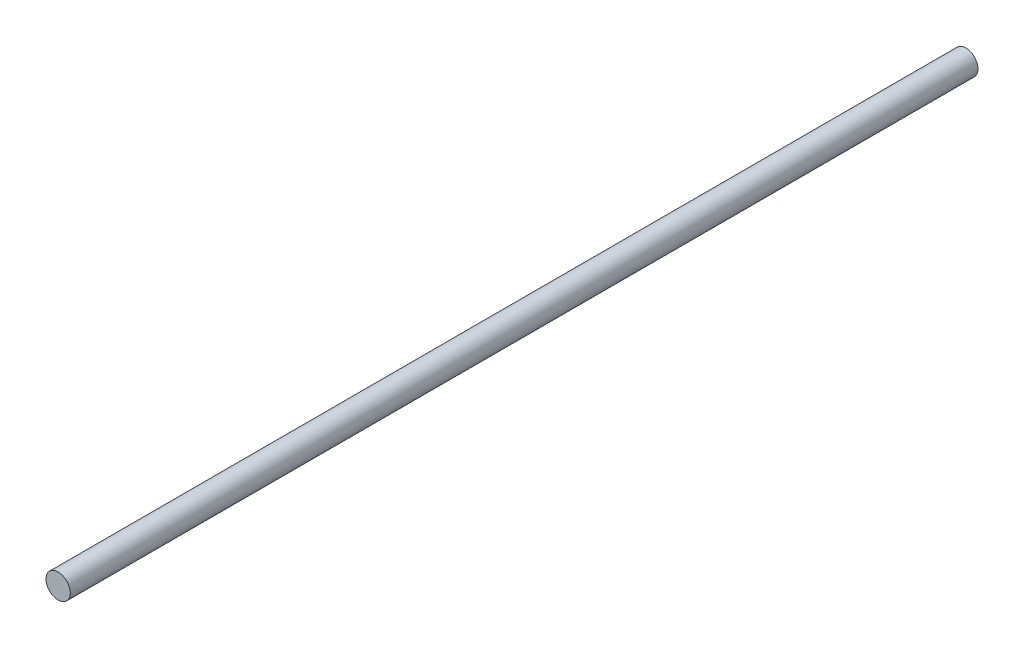
ISO-10303-21;
HEADER;
FILE_DESCRIPTION(('STEP AP214'),'2;1');
FILE_NAME('part.step','',(''),(''),'','','');
FILE_SCHEMA(('AUTOMOTIVE_DESIGN { 1 0 10303 214 1 1 1 1 }'));
ENDSEC;
DATA;
#1=APPLICATION_CONTEXT('core data for automotive mechanical design processes');
#2=APPLICATION_PROTOCOL_DEFINITION('international standard','automotive_design',2000,#1);
#3=PRODUCT_CONTEXT('',#1,'mechanical');
#4=PRODUCT('Part','Part','',(#3));
#5=PRODUCT_RELATED_PRODUCT_CATEGORY('part','',(#4));
#6=PRODUCT_DEFINITION_FORMATION('','',#4);
#7=PRODUCT_DEFINITION_CONTEXT('part definition',#1,'design');
#8=PRODUCT_DEFINITION('design','',#6,#7);
#9=PRODUCT_DEFINITION_SHAPE('','',#8);
#10=(LENGTH_UNIT() NAMED_UNIT(*) SI_UNIT(.MILLI.,.METRE.));
#11=(NAMED_UNIT(*) PLANE_ANGLE_UNIT() SI_UNIT($,.RADIAN.));
#12=(NAMED_UNIT(*) SI_UNIT($,.STERADIAN.) SOLID_ANGLE_UNIT());
#13=UNCERTAINTY_MEASURE_WITH_UNIT(LENGTH_MEASURE(1.E-05),#10,'distance_accuracy_value','');
#14=(GEOMETRIC_REPRESENTATION_CONTEXT(3) GLOBAL_UNCERTAINTY_ASSIGNED_CONTEXT((#13)) GLOBAL_UNIT_ASSIGNED_CONTEXT((#10,
#11,#12)) REPRESENTATION_CONTEXT('',''));
#15=CARTESIAN_POINT('',(0.,0.,0.));
#16=DIRECTION('',(0.,0.,1.));
#17=DIRECTION('',(1.,0.,0.));
#18=AXIS2_PLACEMENT_3D('',#15,#16,#17);
#19=CARTESIAN_POINT('',(0.,0.,177.8));
#20=DIRECTION('',(0.,0.,-1.));
#21=DIRECTION('',(-1.,0.,0.));
#22=AXIS2_PLACEMENT_3D('',#19,#20,#21);
#23=CYLINDRICAL_SURFACE('',#22,2.38125);
#24=CARTESIAN_POINT('',(0.,0.,177.8));
#25=DIRECTION('',(0.,0.,1.));
#26=DIRECTION('',(1.,0.,0.));
#27=AXIS2_PLACEMENT_3D('',#24,#25,#26);
#28=CIRCLE('',#27,2.38125);
#29=CARTESIAN_POINT('',(2.38125,0.,177.8));
#30=VERTEX_POINT('',#29);
#31=EDGE_CURVE('E10',#30,#30,#28,.T.);
#32=ORIENTED_EDGE('',*,*,#31,.F.);
#33=EDGE_LOOP('',(#32));
#34=FACE_BOUND('',#33,.T.);
#35=CARTESIAN_POINT('',(0.,0.,0.));
#36=DIRECTION('',(0.,0.,1.));
#37=DIRECTION('',(1.,0.,0.));
#38=AXIS2_PLACEMENT_3D('',#35,#36,#37);
#39=CIRCLE('',#38,2.38125);
#40=CARTESIAN_POINT('',(2.38125,0.,0.));
#41=VERTEX_POINT('',#40);
#42=EDGE_CURVE('E35',#41,#41,#39,.T.);
#43=ORIENTED_EDGE('',*,*,#42,.T.);
#44=EDGE_LOOP('',(#43));
#45=FACE_BOUND('',#44,.T.);
#46=ADVANCED_FACE('F32',(#34,#45),#23,.T.);
#47=CARTESIAN_POINT('',(0.,0.,177.8));
#48=DIRECTION('',(0.,0.,1.));
#49=DIRECTION('',(1.,0.,0.));
#50=AXIS2_PLACEMENT_3D('',#47,#48,#49);
#51=PLANE('',#50);
#52=ORIENTED_EDGE('',*,*,#31,.T.);
#53=EDGE_LOOP('',(#52));
#54=FACE_BOUND('',#53,.T.);
#55=ADVANCED_FACE('F47',(#54),#51,.T.);
#56=CARTESIAN_POINT('',(0.,0.,0.));
#57=DIRECTION('',(0.,0.,1.));
#58=DIRECTION('',(1.,0.,0.));
#59=AXIS2_PLACEMENT_3D('',#56,#57,#58);
#60=PLANE('',#59);
#61=ORIENTED_EDGE('',*,*,#42,.F.);
#62=EDGE_LOOP('',(#61));
#63=FACE_BOUND('',#62,.T.);
#64=ADVANCED_FACE('F45',(#63),#60,.F.);
#65=CLOSED_SHELL('',(#46,#55,#64));
#66=MANIFOLD_SOLID_BREP('B2',#65);
#67=ADVANCED_BREP_SHAPE_REPRESENTATION('',(#18,#66),#14);
#68=SHAPE_DEFINITION_REPRESENTATION(#9,#67);
ENDSEC;
END-ISO-10303-21;
